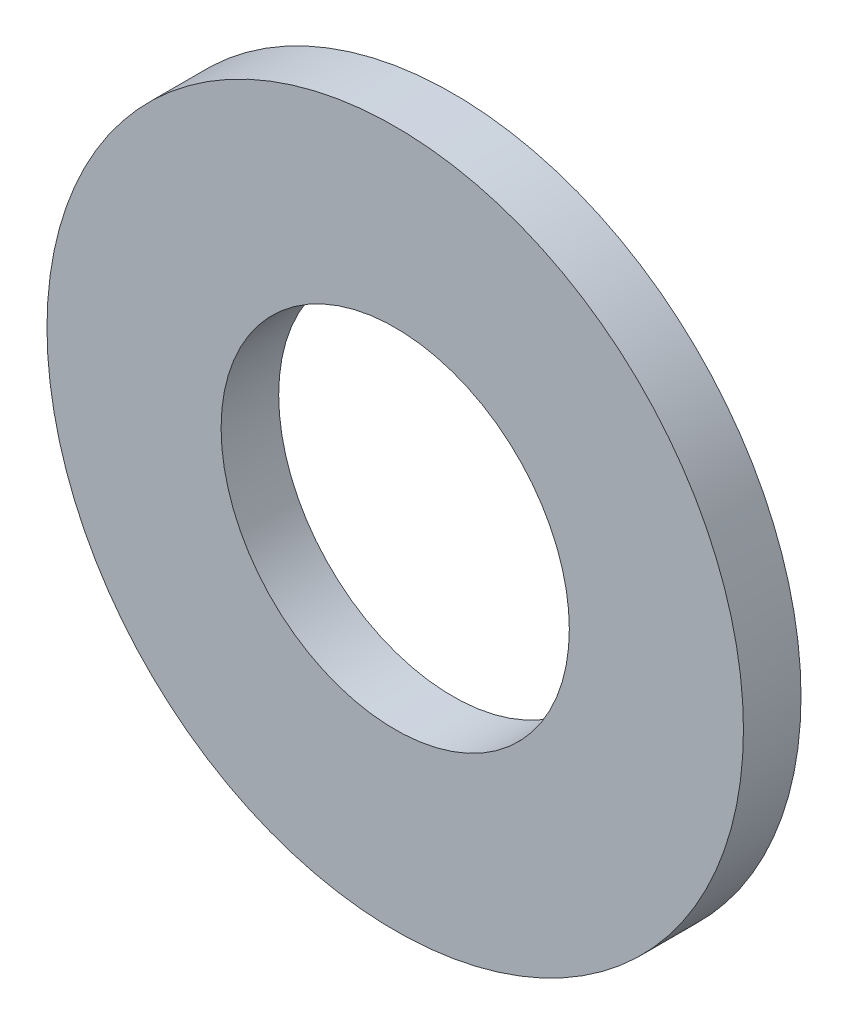
ISO-10303-21;
HEADER;
FILE_DESCRIPTION(('STEP AP214'),'2;1');
FILE_NAME('part.step','',(''),(''),'','','');
FILE_SCHEMA(('AUTOMOTIVE_DESIGN { 1 0 10303 214 1 1 1 1 }'));
ENDSEC;
DATA;
#1=APPLICATION_CONTEXT('core data for automotive mechanical design processes');
#2=APPLICATION_PROTOCOL_DEFINITION('international standard','automotive_design',2000,#1);
#3=PRODUCT_CONTEXT('',#1,'mechanical');
#4=PRODUCT('Part','Part','',(#3));
#5=PRODUCT_RELATED_PRODUCT_CATEGORY('part','',(#4));
#6=PRODUCT_DEFINITION_FORMATION('','',#4);
#7=PRODUCT_DEFINITION_CONTEXT('part definition',#1,'design');
#8=PRODUCT_DEFINITION('design','',#6,#7);
#9=PRODUCT_DEFINITION_SHAPE('','',#8);
#10=(LENGTH_UNIT() NAMED_UNIT(*) SI_UNIT(.MILLI.,.METRE.));
#11=(NAMED_UNIT(*) PLANE_ANGLE_UNIT() SI_UNIT($,.RADIAN.));
#12=(NAMED_UNIT(*) SI_UNIT($,.STERADIAN.) SOLID_ANGLE_UNIT());
#13=UNCERTAINTY_MEASURE_WITH_UNIT(LENGTH_MEASURE(1.E-05),#10,'distance_accuracy_value','');
#14=(GEOMETRIC_REPRESENTATION_CONTEXT(3) GLOBAL_UNCERTAINTY_ASSIGNED_CONTEXT((#13)) GLOBAL_UNIT_ASSIGNED_CONTEXT((#10,
#11,#12)) REPRESENTATION_CONTEXT('',''));
#15=CARTESIAN_POINT('',(0.,0.,0.));
#16=DIRECTION('',(0.,0.,1.));
#17=DIRECTION('',(1.,0.,0.));
#18=AXIS2_PLACEMENT_3D('',#15,#16,#17);
#19=CARTESIAN_POINT('',(0.,0.,1.5748));
#20=DIRECTION('',(0.,0.,-1.));
#21=DIRECTION('',(-1.,0.,0.));
#22=AXIS2_PLACEMENT_3D('',#19,#20,#21);
#23=PLANE('',#22);
#24=CARTESIAN_POINT('',(0.,0.,1.5748));
#25=DIRECTION('',(0.,0.,1.));
#26=DIRECTION('',(1.,0.,0.));
#27=AXIS2_PLACEMENT_3D('',#24,#25,#26);
#28=CIRCLE('',#27,4.7625);
#29=CARTESIAN_POINT('',(4.7625,0.,1.5748));
#30=VERTEX_POINT('',#29);
#31=EDGE_CURVE('E27',#30,#30,#28,.F.);
#32=ORIENTED_EDGE('',*,*,#31,.T.);
#33=EDGE_LOOP('',(#32));
#34=FACE_BOUND('',#33,.T.);
#35=CARTESIAN_POINT('',(0.,0.,1.5748));
#36=DIRECTION('',(0.,0.,1.));
#37=DIRECTION('',(1.,0.,0.));
#38=AXIS2_PLACEMENT_3D('',#35,#36,#37);
#39=CIRCLE('',#38,9.525);
#40=CARTESIAN_POINT('',(9.525,0.,1.5748));
#41=VERTEX_POINT('',#40);
#42=EDGE_CURVE('E18',#41,#41,#39,.F.);
#43=ORIENTED_EDGE('',*,*,#42,.F.);
#44=EDGE_LOOP('',(#43));
#45=FACE_BOUND('',#44,.T.);
#46=ADVANCED_FACE('F15',(#34,#45),#23,.F.);
#47=CARTESIAN_POINT('',(0.,0.,0.));
#48=DIRECTION('',(0.,0.,1.));
#49=DIRECTION('',(1.,0.,0.));
#50=AXIS2_PLACEMENT_3D('',#47,#48,#49);
#51=CYLINDRICAL_SURFACE('',#50,9.525);
#52=CARTESIAN_POINT('',(0.,0.,0.));
#53=DIRECTION('',(0.,0.,1.));
#54=DIRECTION('',(1.,0.,0.));
#55=AXIS2_PLACEMENT_3D('',#52,#53,#54);
#56=CIRCLE('',#55,9.525);
#57=CARTESIAN_POINT('',(9.525,0.,0.));
#58=VERTEX_POINT('',#57);
#59=EDGE_CURVE('E22',#58,#58,#56,.F.);
#60=ORIENTED_EDGE('',*,*,#59,.F.);
#61=EDGE_LOOP('',(#60));
#62=FACE_BOUND('',#61,.T.);
#63=ORIENTED_EDGE('',*,*,#42,.T.);
#64=EDGE_LOOP('',(#63));
#65=FACE_BOUND('',#64,.T.);
#66=ADVANCED_FACE('F35',(#62,#65),#51,.T.);
#67=CARTESIAN_POINT('',(0.,0.,0.));
#68=DIRECTION('',(0.,0.,1.));
#69=DIRECTION('',(1.,0.,0.));
#70=AXIS2_PLACEMENT_3D('',#67,#68,#69);
#71=CYLINDRICAL_SURFACE('',#70,4.7625);
#72=CARTESIAN_POINT('',(0.,0.,0.));
#73=DIRECTION('',(0.,0.,1.));
#74=DIRECTION('',(1.,0.,0.));
#75=AXIS2_PLACEMENT_3D('',#72,#73,#74);
#76=CIRCLE('',#75,4.7625);
#77=CARTESIAN_POINT('',(4.7625,0.,0.));
#78=VERTEX_POINT('',#77);
#79=EDGE_CURVE('E10',#78,#78,#76,.T.);
#80=ORIENTED_EDGE('',*,*,#79,.F.);
#81=EDGE_LOOP('',(#80));
#82=FACE_BOUND('',#81,.T.);
#83=ORIENTED_EDGE('',*,*,#31,.F.);
#84=EDGE_LOOP('',(#83));
#85=FACE_BOUND('',#84,.T.);
#86=ADVANCED_FACE('F42',(#82,#85),#71,.F.);
#87=CARTESIAN_POINT('',(0.,0.,0.));
#88=DIRECTION('',(0.,0.,-1.));
#89=DIRECTION('',(-1.,0.,0.));
#90=AXIS2_PLACEMENT_3D('',#87,#88,#89);
#91=PLANE('',#90);
#92=ORIENTED_EDGE('',*,*,#79,.T.);
#93=EDGE_LOOP('',(#92));
#94=FACE_BOUND('',#93,.T.);
#95=ORIENTED_EDGE('',*,*,#59,.T.);
#96=EDGE_LOOP('',(#95));
#97=FACE_BOUND('',#96,.T.);
#98=ADVANCED_FACE('F44',(#94,#97),#91,.T.);
#99=CLOSED_SHELL('',(#46,#66,#86,#98));
#100=MANIFOLD_SOLID_BREP('B1',#99);
#101=ADVANCED_BREP_SHAPE_REPRESENTATION('',(#18,#100),#14);
#102=SHAPE_DEFINITION_REPRESENTATION(#9,#101);
ENDSEC;
END-ISO-10303-21;
